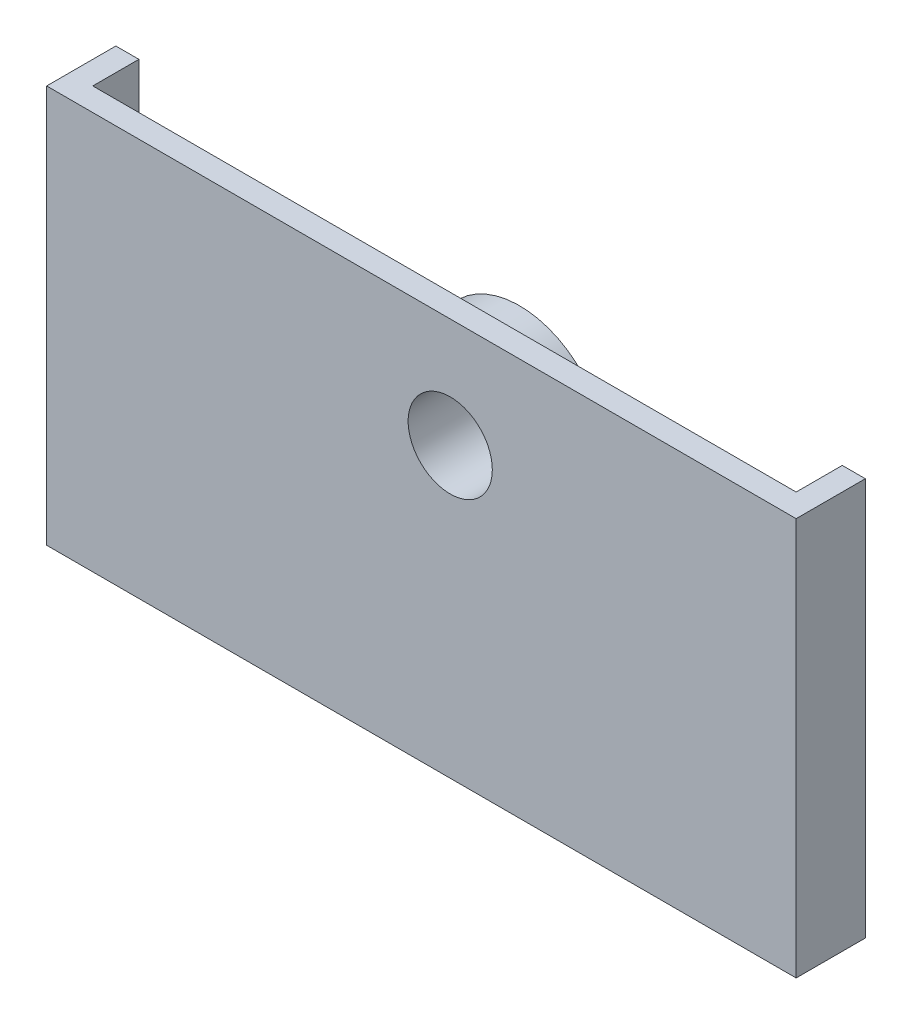
ISO-10303-21;
HEADER;
FILE_DESCRIPTION(('STEP AP214'),'2;1');
FILE_NAME('part.step','',(''),(''),'','','');
FILE_SCHEMA(('AUTOMOTIVE_DESIGN { 1 0 10303 214 1 1 1 1 }'));
ENDSEC;
DATA;
#1=APPLICATION_CONTEXT('core data for automotive mechanical design processes');
#2=APPLICATION_PROTOCOL_DEFINITION('international standard','automotive_design',2000,#1);
#3=PRODUCT_CONTEXT('',#1,'mechanical');
#4=PRODUCT('Part','Part','',(#3));
#5=PRODUCT_RELATED_PRODUCT_CATEGORY('part','',(#4));
#6=PRODUCT_DEFINITION_FORMATION('','',#4);
#7=PRODUCT_DEFINITION_CONTEXT('part definition',#1,'design');
#8=PRODUCT_DEFINITION('design','',#6,#7);
#9=PRODUCT_DEFINITION_SHAPE('','',#8);
#10=(LENGTH_UNIT() NAMED_UNIT(*) SI_UNIT(.MILLI.,.METRE.));
#11=(NAMED_UNIT(*) PLANE_ANGLE_UNIT() SI_UNIT($,.RADIAN.));
#12=(NAMED_UNIT(*) SI_UNIT($,.STERADIAN.) SOLID_ANGLE_UNIT());
#13=UNCERTAINTY_MEASURE_WITH_UNIT(LENGTH_MEASURE(1.E-05),#10,'distance_accuracy_value','');
#14=(GEOMETRIC_REPRESENTATION_CONTEXT(3) GLOBAL_UNCERTAINTY_ASSIGNED_CONTEXT((#13)) GLOBAL_UNIT_ASSIGNED_CONTEXT((#10,
#11,#12)) REPRESENTATION_CONTEXT('',''));
#15=CARTESIAN_POINT('',(0.,0.,0.));
#16=DIRECTION('',(0.,0.,1.));
#17=DIRECTION('',(1.,0.,0.));
#18=AXIS2_PLACEMENT_3D('',#15,#16,#17);
#19=CARTESIAN_POINT('',(-33.,-23.,-73.5883822352414));
#20=DIRECTION('',(-1.,0.,0.));
#21=DIRECTION('',(0.,0.,1.));
#22=AXIS2_PLACEMENT_3D('',#19,#20,#21);
#23=PLANE('',#22);
#24=DIRECTION('',(0.,-1.,0.));
#25=VECTOR('',#24,1.);
#26=CARTESIAN_POINT('',(-33.,-23.,4.));
#27=LINE('',#26,#25);
#28=CARTESIAN_POINT('',(-33.,9.5,4.));
#29=VERTEX_POINT('',#28);
#30=CARTESIAN_POINT('',(-33.,3.,4.));
#31=VERTEX_POINT('',#30);
#32=EDGE_CURVE('E270',#29,#31,#27,.T.);
#33=ORIENTED_EDGE('',*,*,#32,.T.);
#34=DIRECTION('',(0.,0.,-1.));
#35=VECTOR('',#34,1.);
#36=CARTESIAN_POINT('',(-33.,3.,5.));
#37=LINE('',#36,#35);
#38=CARTESIAN_POINT('',(-33.,3.,0.));
#39=VERTEX_POINT('',#38);
#40=EDGE_CURVE('E215',#31,#39,#37,.T.);
#41=ORIENTED_EDGE('',*,*,#40,.T.);
#42=DIRECTION('',(0.,1.,0.));
#43=VECTOR('',#42,1.);
#44=CARTESIAN_POINT('',(-33.,-23.,0.));
#45=LINE('',#44,#43);
#46=CARTESIAN_POINT('',(-33.,9.5,0.));
#47=VERTEX_POINT('',#46);
#48=EDGE_CURVE('E258',#39,#47,#45,.T.);
#49=ORIENTED_EDGE('',*,*,#48,.T.);
#50=DIRECTION('',(0.,0.,1.));
#51=VECTOR('',#50,1.);
#52=CARTESIAN_POINT('',(-33.,9.5,-73.5883822352414));
#53=LINE('',#52,#51);
#54=EDGE_CURVE('E286',#47,#29,#53,.T.);
#55=ORIENTED_EDGE('',*,*,#54,.T.);
#56=EDGE_LOOP('',(#33,#41,#49,#55));
#57=FACE_BOUND('',#56,.T.);
#58=ADVANCED_FACE('F41',(#57),#23,.F.);
#59=CARTESIAN_POINT('',(0.,0.,0.));
#60=DIRECTION('',(0.,0.,1.));
#61=DIRECTION('',(1.,0.,0.));
#62=AXIS2_PLACEMENT_3D('',#59,#60,#61);
#63=PLANE('',#62);
#64=ORIENTED_EDGE('',*,*,#48,.F.);
#65=DIRECTION('',(1.,0.,0.));
#66=VECTOR('',#65,1.);
#67=CARTESIAN_POINT('',(-33.,3.,0.));
#68=LINE('',#67,#66);
#69=CARTESIAN_POINT('',(-35.,3.,0.));
#70=VERTEX_POINT('',#69);
#71=EDGE_CURVE('E209',#70,#39,#68,.T.);
#72=ORIENTED_EDGE('',*,*,#71,.F.);
#73=DIRECTION('',(0.,-1.,0.));
#74=VECTOR('',#73,1.);
#75=CARTESIAN_POINT('',(-35.,-25.,0.));
#76=LINE('',#75,#74);
#77=CARTESIAN_POINT('',(-35.,9.5,0.));
#78=VERTEX_POINT('',#77);
#79=EDGE_CURVE('E266',#78,#70,#76,.T.);
#80=ORIENTED_EDGE('',*,*,#79,.F.);
#81=DIRECTION('',(-1.,0.,0.));
#82=VECTOR('',#81,1.);
#83=CARTESIAN_POINT('',(-35.,9.5,0.));
#84=LINE('',#83,#82);
#85=EDGE_CURVE('E262',#47,#78,#84,.T.);
#86=ORIENTED_EDGE('',*,*,#85,.F.);
#87=EDGE_LOOP('',(#64,#72,#80,#86));
#88=FACE_BOUND('',#87,.T.);
#89=ADVANCED_FACE('F411',(#88),#63,.F.);
#90=DIRECTION('',(1.,0.,0.));
#91=VECTOR('',#90,1.);
#92=CARTESIAN_POINT('',(30.,-25.,0.));
#93=LINE('',#92,#91);
#94=CARTESIAN_POINT('',(5.,-25.,0.));
#95=VERTEX_POINT('',#94);
#96=CARTESIAN_POINT('',(30.,-25.,0.));
#97=VERTEX_POINT('',#96);
#98=EDGE_CURVE('E288',#95,#97,#93,.T.);
#99=ORIENTED_EDGE('',*,*,#98,.F.);
#100=DIRECTION('',(0.,-1.,0.));
#101=VECTOR('',#100,1.);
#102=CARTESIAN_POINT('',(5.,-23.,0.));
#103=LINE('',#102,#101);
#104=CARTESIAN_POINT('',(5.,-23.,0.));
#105=VERTEX_POINT('',#104);
#106=EDGE_CURVE('E218',#105,#95,#103,.T.);
#107=ORIENTED_EDGE('',*,*,#106,.F.);
#108=DIRECTION('',(-1.,0.,0.));
#109=VECTOR('',#108,1.);
#110=CARTESIAN_POINT('',(28.,-23.,0.));
#111=LINE('',#110,#109);
#112=CARTESIAN_POINT('',(28.,-23.,0.));
#113=VERTEX_POINT('',#112);
#114=EDGE_CURVE('E255',#113,#105,#111,.T.);
#115=ORIENTED_EDGE('',*,*,#114,.F.);
#116=DIRECTION('',(0.,-1.,0.));
#117=VECTOR('',#116,1.);
#118=CARTESIAN_POINT('',(28.,7.49999999999999,0.));
#119=LINE('',#118,#117);
#120=CARTESIAN_POINT('',(28.,9.49999999999999,0.));
#121=VERTEX_POINT('',#120);
#122=EDGE_CURVE('E251',#121,#113,#119,.T.);
#123=ORIENTED_EDGE('',*,*,#122,.F.);
#124=DIRECTION('',(-1.,0.,0.));
#125=VECTOR('',#124,1.);
#126=CARTESIAN_POINT('',(28.,9.49999999999999,0.));
#127=LINE('',#126,#125);
#128=CARTESIAN_POINT('',(30.,9.5,0.));
#129=VERTEX_POINT('',#128);
#130=EDGE_CURVE('E247',#129,#121,#127,.T.);
#131=ORIENTED_EDGE('',*,*,#130,.F.);
#132=DIRECTION('',(0.,1.,0.));
#133=VECTOR('',#132,1.);
#134=CARTESIAN_POINT('',(30.,9.5,0.));
#135=LINE('',#134,#133);
#136=EDGE_CURVE('E244',#97,#129,#135,.T.);
#137=ORIENTED_EDGE('',*,*,#136,.F.);
#138=EDGE_LOOP('',(#99,#107,#115,#123,#131,#137));
#139=FACE_BOUND('',#138,.T.);
#140=ADVANCED_FACE('F376',(#139),#63,.F.);
#141=CARTESIAN_POINT('',(0.,0.,4.));
#142=DIRECTION('',(0.,0.,-1.));
#143=DIRECTION('',(-1.,0.,0.));
#144=AXIS2_PLACEMENT_3D('',#141,#142,#143);
#145=PLANE('',#144);
#146=DIRECTION('',(-1.,0.,0.));
#147=VECTOR('',#146,1.);
#148=CARTESIAN_POINT('',(-9.95012437887911,-7.,4.));
#149=LINE('',#148,#147);
#150=CARTESIAN_POINT('',(-27.5,-7.,4.));
#151=VERTEX_POINT('',#150);
#152=CARTESIAN_POINT('',(-33.,-7.,4.));
#153=VERTEX_POINT('',#152);
#154=EDGE_CURVE('E180',#151,#153,#149,.T.);
#155=ORIENTED_EDGE('',*,*,#154,.F.);
#156=DIRECTION('',(0.,-1.,0.));
#157=VECTOR('',#156,1.);
#158=CARTESIAN_POINT('',(-27.5,3.,4.));
#159=LINE('',#158,#157);
#160=CARTESIAN_POINT('',(-27.5,3.,4.));
#161=VERTEX_POINT('',#160);
#162=EDGE_CURVE('E189',#161,#151,#159,.T.);
#163=ORIENTED_EDGE('',*,*,#162,.F.);
#164=DIRECTION('',(-1.,0.,0.));
#165=VECTOR('',#164,1.);
#166=CARTESIAN_POINT('',(-9.95012437887911,3.,4.));
#167=LINE('',#166,#165);
#168=EDGE_CURVE('E204',#161,#31,#167,.T.);
#169=ORIENTED_EDGE('',*,*,#168,.T.);
#170=ORIENTED_EDGE('',*,*,#32,.F.);
#171=DIRECTION('',(-1.,0.,0.));
#172=VECTOR('',#171,1.);
#173=CARTESIAN_POINT('',(-35.,9.5,4.));
#174=LINE('',#173,#172);
#175=CARTESIAN_POINT('',(28.,9.49999999999999,4.));
#176=VERTEX_POINT('',#175);
#177=EDGE_CURVE('E293',#176,#29,#174,.T.);
#178=ORIENTED_EDGE('',*,*,#177,.F.);
#179=DIRECTION('',(0.,1.,0.));
#180=VECTOR('',#179,1.);
#181=CARTESIAN_POINT('',(28.,7.49999999999999,4.));
#182=LINE('',#181,#180);
#183=CARTESIAN_POINT('',(28.,-23.,4.));
#184=VERTEX_POINT('',#183);
#185=EDGE_CURVE('E276',#184,#176,#182,.T.);
#186=ORIENTED_EDGE('',*,*,#185,.F.);
#187=DIRECTION('',(1.,0.,0.));
#188=VECTOR('',#187,1.);
#189=CARTESIAN_POINT('',(28.,-23.,4.));
#190=LINE('',#189,#188);
#191=CARTESIAN_POINT('',(-33.,-23.,4.));
#192=VERTEX_POINT('',#191);
#193=EDGE_CURVE('E273',#192,#184,#190,.T.);
#194=ORIENTED_EDGE('',*,*,#193,.F.);
#195=EDGE_CURVE('E200',#153,#192,#27,.T.);
#196=ORIENTED_EDGE('',*,*,#195,.F.);
#197=EDGE_LOOP('',(#155,#163,#169,#170,#178,#186,#194,#196));
#198=FACE_BOUND('',#197,.T.);
#199=CARTESIAN_POINT('',(0.,0.,4.));
#200=DIRECTION('',(0.,0.,1.));
#201=DIRECTION('',(1.,0.,0.));
#202=AXIS2_PLACEMENT_3D('',#199,#200,#201);
#203=CIRCLE('',#202,7.5);
#204=CARTESIAN_POINT('',(7.5,0.,4.));
#205=VERTEX_POINT('',#204);
#206=EDGE_CURVE('E319',#205,#205,#203,.T.);
#207=ORIENTED_EDGE('',*,*,#206,.T.);
#208=EDGE_LOOP('',(#207));
#209=FACE_BOUND('',#208,.T.);
#210=ADVANCED_FACE('F197',(#198,#209),#145,.T.);
#211=CARTESIAN_POINT('',(0.,0.,0.));
#212=DIRECTION('',(0.,0.,1.));
#213=DIRECTION('',(1.,0.,0.));
#214=AXIS2_PLACEMENT_3D('',#211,#212,#213);
#215=PLANE('',#214);
#216=CARTESIAN_POINT('',(0.,0.,0.));
#217=DIRECTION('',(0.,0.,1.));
#218=DIRECTION('',(1.,0.,0.));
#219=AXIS2_PLACEMENT_3D('',#216,#217,#218);
#220=CIRCLE('',#219,7.5);
#221=CARTESIAN_POINT('',(7.5,0.,0.));
#222=VERTEX_POINT('',#221);
#223=EDGE_CURVE('E318',#222,#222,#220,.T.);
#224=ORIENTED_EDGE('',*,*,#223,.F.);
#225=EDGE_LOOP('',(#224));
#226=FACE_BOUND('',#225,.T.);
#227=CARTESIAN_POINT('',(0.,0.,0.));
#228=DIRECTION('',(0.,0.,1.));
#229=DIRECTION('',(1.,0.,0.));
#230=AXIS2_PLACEMENT_3D('',#227,#228,#229);
#231=CIRCLE('',#230,3.65);
#232=CARTESIAN_POINT('',(3.65,0.,0.));
#233=VERTEX_POINT('',#232);
#234=EDGE_CURVE('E315',#233,#233,#231,.T.);
#235=ORIENTED_EDGE('',*,*,#234,.T.);
#236=EDGE_LOOP('',(#235));
#237=FACE_BOUND('',#236,.T.);
#238=ADVANCED_FACE('F506',(#226,#237),#215,.F.);
#239=CARTESIAN_POINT('',(0.,0.,4.));
#240=DIRECTION('',(0.,0.,-1.));
#241=DIRECTION('',(-1.,0.,0.));
#242=AXIS2_PLACEMENT_3D('',#239,#240,#241);
#243=CYLINDRICAL_SURFACE('',#242,7.5);
#244=ORIENTED_EDGE('',*,*,#206,.F.);
#245=EDGE_LOOP('',(#244));
#246=FACE_BOUND('',#245,.T.);
#247=ORIENTED_EDGE('',*,*,#223,.T.);
#248=EDGE_LOOP('',(#247));
#249=FACE_BOUND('',#248,.T.);
#250=ADVANCED_FACE('F568',(#246,#249),#243,.T.);
#251=CARTESIAN_POINT('',(0.,0.,4.));
#252=DIRECTION('',(0.,0.,-1.));
#253=DIRECTION('',(-1.,0.,0.));
#254=AXIS2_PLACEMENT_3D('',#251,#252,#253);
#255=CYLINDRICAL_SURFACE('',#254,3.65);
#256=ORIENTED_EDGE('',*,*,#234,.F.);
#257=EDGE_LOOP('',(#256));
#258=FACE_BOUND('',#257,.T.);
#259=CARTESIAN_POINT('',(0.,0.,6.));
#260=DIRECTION('',(0.,0.,1.));
#261=DIRECTION('',(1.,0.,0.));
#262=AXIS2_PLACEMENT_3D('',#259,#260,#261);
#263=CIRCLE('',#262,3.65);
#264=CARTESIAN_POINT('',(3.65,0.,6.));
#265=VERTEX_POINT('',#264);
#266=EDGE_CURVE('E269',#265,#265,#263,.T.);
#267=ORIENTED_EDGE('',*,*,#266,.T.);
#268=EDGE_LOOP('',(#267));
#269=FACE_BOUND('',#268,.T.);
#270=ADVANCED_FACE('F565',(#258,#269),#255,.F.);
#271=CARTESIAN_POINT('',(0.,0.,6.));
#272=DIRECTION('',(0.,0.,-1.));
#273=DIRECTION('',(-1.,0.,0.));
#274=AXIS2_PLACEMENT_3D('',#271,#272,#273);
#275=PLANE('',#274);
#276=DIRECTION('',(-1.,0.,0.));
#277=VECTOR('',#276,1.);
#278=CARTESIAN_POINT('',(-35.,9.5,6.));
#279=LINE('',#278,#277);
#280=CARTESIAN_POINT('',(30.,9.5,6.));
#281=VERTEX_POINT('',#280);
#282=CARTESIAN_POINT('',(-35.,9.5,6.));
#283=VERTEX_POINT('',#282);
#284=EDGE_CURVE('E294',#281,#283,#279,.T.);
#285=ORIENTED_EDGE('',*,*,#284,.T.);
#286=DIRECTION('',(0.,-1.,0.));
#287=VECTOR('',#286,1.);
#288=CARTESIAN_POINT('',(-35.,-25.,6.));
#289=LINE('',#288,#287);
#290=CARTESIAN_POINT('',(-35.,-25.,6.));
#291=VERTEX_POINT('',#290);
#292=EDGE_CURVE('E297',#283,#291,#289,.T.);
#293=ORIENTED_EDGE('',*,*,#292,.T.);
#294=DIRECTION('',(1.,0.,0.));
#295=VECTOR('',#294,1.);
#296=CARTESIAN_POINT('',(30.,-25.,6.));
#297=LINE('',#296,#295);
#298=CARTESIAN_POINT('',(30.,-25.,6.));
#299=VERTEX_POINT('',#298);
#300=EDGE_CURVE('E299',#291,#299,#297,.T.);
#301=ORIENTED_EDGE('',*,*,#300,.T.);
#302=DIRECTION('',(0.,1.,0.));
#303=VECTOR('',#302,1.);
#304=CARTESIAN_POINT('',(30.,9.5,6.));
#305=LINE('',#304,#303);
#306=EDGE_CURVE('E301',#299,#281,#305,.T.);
#307=ORIENTED_EDGE('',*,*,#306,.T.);
#308=EDGE_LOOP('',(#285,#293,#301,#307));
#309=FACE_BOUND('',#308,.T.);
#310=ORIENTED_EDGE('',*,*,#266,.F.);
#311=EDGE_LOOP('',(#310));
#312=FACE_BOUND('',#311,.T.);
#313=ADVANCED_FACE('F387',(#309,#312),#275,.F.);
#314=CARTESIAN_POINT('',(-35.,9.5,6.));
#315=DIRECTION('',(0.,-1.,0.));
#316=DIRECTION('',(0.,0.,-1.));
#317=AXIS2_PLACEMENT_3D('',#314,#315,#316);
#318=PLANE('',#317);
#319=DIRECTION('',(0.,0.,-1.));
#320=VECTOR('',#319,1.);
#321=CARTESIAN_POINT('',(30.,9.5,6.));
#322=LINE('',#321,#320);
#323=EDGE_CURVE('E303',#281,#129,#322,.T.);
#324=ORIENTED_EDGE('',*,*,#323,.T.);
#325=ORIENTED_EDGE('',*,*,#130,.T.);
#326=DIRECTION('',(0.,0.,1.));
#327=VECTOR('',#326,1.);
#328=CARTESIAN_POINT('',(28.,9.49999999999999,-73.5883822352414));
#329=LINE('',#328,#327);
#330=EDGE_CURVE('E279',#121,#176,#329,.T.);
#331=ORIENTED_EDGE('',*,*,#330,.T.);
#332=ORIENTED_EDGE('',*,*,#177,.T.);
#333=ORIENTED_EDGE('',*,*,#54,.F.);
#334=ORIENTED_EDGE('',*,*,#85,.T.);
#335=DIRECTION('',(0.,0.,-1.));
#336=VECTOR('',#335,1.);
#337=CARTESIAN_POINT('',(-35.,9.5,6.));
#338=LINE('',#337,#336);
#339=EDGE_CURVE('E313',#283,#78,#338,.T.);
#340=ORIENTED_EDGE('',*,*,#339,.F.);
#341=ORIENTED_EDGE('',*,*,#284,.F.);
#342=EDGE_LOOP('',(#324,#325,#331,#332,#333,#334,#340,#341));
#343=FACE_BOUND('',#342,.T.);
#344=ADVANCED_FACE('F405',(#343),#318,.F.);
#345=CARTESIAN_POINT('',(-35.,-25.,6.));
#346=DIRECTION('',(1.,0.,0.));
#347=DIRECTION('',(0.,1.,0.));
#348=AXIS2_PLACEMENT_3D('',#345,#346,#347);
#349=PLANE('',#348);
#350=ORIENTED_EDGE('',*,*,#79,.T.);
#351=DIRECTION('',(0.,0.,-1.));
#352=VECTOR('',#351,1.);
#353=CARTESIAN_POINT('',(-35.,3.,5.));
#354=LINE('',#353,#352);
#355=CARTESIAN_POINT('',(-35.,3.,5.));
#356=VERTEX_POINT('',#355);
#357=EDGE_CURVE('E219',#356,#70,#354,.T.);
#358=ORIENTED_EDGE('',*,*,#357,.F.);
#359=DIRECTION('',(0.,1.,0.));
#360=VECTOR('',#359,1.);
#361=CARTESIAN_POINT('',(-35.,3.,5.));
#362=LINE('',#361,#360);
#363=CARTESIAN_POINT('',(-35.,-7.,5.));
#364=VERTEX_POINT('',#363);
#365=EDGE_CURVE('E208',#364,#356,#362,.T.);
#366=ORIENTED_EDGE('',*,*,#365,.F.);
#367=DIRECTION('',(0.,0.,-1.));
#368=VECTOR('',#367,1.);
#369=CARTESIAN_POINT('',(-35.,-7.,5.));
#370=LINE('',#369,#368);
#371=CARTESIAN_POINT('',(-35.,-7.,0.));
#372=VERTEX_POINT('',#371);
#373=EDGE_CURVE('E221',#364,#372,#370,.T.);
#374=ORIENTED_EDGE('',*,*,#373,.T.);
#375=CARTESIAN_POINT('',(-35.,-25.,0.));
#376=VERTEX_POINT('',#375);
#377=EDGE_CURVE('E265',#372,#376,#76,.T.);
#378=ORIENTED_EDGE('',*,*,#377,.T.);
#379=DIRECTION('',(0.,0.,-1.));
#380=VECTOR('',#379,1.);
#381=CARTESIAN_POINT('',(-35.,-25.,6.));
#382=LINE('',#381,#380);
#383=EDGE_CURVE('E310',#291,#376,#382,.T.);
#384=ORIENTED_EDGE('',*,*,#383,.F.);
#385=ORIENTED_EDGE('',*,*,#292,.F.);
#386=ORIENTED_EDGE('',*,*,#339,.T.);
#387=EDGE_LOOP('',(#350,#358,#366,#374,#378,#384,#385,#386));
#388=FACE_BOUND('',#387,.T.);
#389=ADVANCED_FACE('F392',(#388),#349,.F.);
#390=CARTESIAN_POINT('',(30.,-25.,6.));
#391=DIRECTION('',(0.,1.,0.));
#392=DIRECTION('',(-1.,0.,0.));
#393=AXIS2_PLACEMENT_3D('',#390,#391,#392);
#394=PLANE('',#393);
#395=DIRECTION('',(-1.,0.,0.));
#396=VECTOR('',#395,1.);
#397=CARTESIAN_POINT('',(5.,-25.,3.7));
#398=LINE('',#397,#396);
#399=CARTESIAN_POINT('',(3.5,-25.,3.7));
#400=VERTEX_POINT('',#399);
#401=CARTESIAN_POINT('',(-3.5,-25.,3.7));
#402=VERTEX_POINT('',#401);
#403=EDGE_CURVE('E225',#400,#402,#398,.T.);
#404=ORIENTED_EDGE('',*,*,#403,.F.);
#405=CARTESIAN_POINT('',(3.5,-25.,2.2));
#406=DIRECTION('',(0.,1.,0.));
#407=DIRECTION('',(-1.,0.,0.));
#408=AXIS2_PLACEMENT_3D('',#405,#406,#407);
#409=CIRCLE('',#408,1.5);
#410=CARTESIAN_POINT('',(5.,-25.,2.2));
#411=VERTEX_POINT('',#410);
#412=EDGE_CURVE('E49',#400,#411,#409,.T.);
#413=ORIENTED_EDGE('',*,*,#412,.T.);
#414=DIRECTION('',(0.,0.,-1.));
#415=VECTOR('',#414,1.);
#416=CARTESIAN_POINT('',(5.,-25.,3.7));
#417=LINE('',#416,#415);
#418=EDGE_CURVE('E232',#411,#95,#417,.T.);
#419=ORIENTED_EDGE('',*,*,#418,.T.);
#420=ORIENTED_EDGE('',*,*,#98,.T.);
#421=DIRECTION('',(0.,0.,-1.));
#422=VECTOR('',#421,1.);
#423=CARTESIAN_POINT('',(30.,-25.,6.));
#424=LINE('',#423,#422);
#425=EDGE_CURVE('E307',#299,#97,#424,.T.);
#426=ORIENTED_EDGE('',*,*,#425,.F.);
#427=ORIENTED_EDGE('',*,*,#300,.F.);
#428=ORIENTED_EDGE('',*,*,#383,.T.);
#429=CARTESIAN_POINT('',(-5.,-25.,0.));
#430=VERTEX_POINT('',#429);
#431=EDGE_CURVE('E248',#376,#430,#93,.T.);
#432=ORIENTED_EDGE('',*,*,#431,.T.);
#433=DIRECTION('',(0.,0.,-1.));
#434=VECTOR('',#433,1.);
#435=CARTESIAN_POINT('',(-5.,-25.,3.7));
#436=LINE('',#435,#434);
#437=CARTESIAN_POINT('',(-5.,-25.,2.2));
#438=VERTEX_POINT('',#437);
#439=EDGE_CURVE('E241',#438,#430,#436,.T.);
#440=ORIENTED_EDGE('',*,*,#439,.F.);
#441=CARTESIAN_POINT('',(-3.5,-25.,2.2));
#442=DIRECTION('',(0.,1.,0.));
#443=DIRECTION('',(-1.,0.,0.));
#444=AXIS2_PLACEMENT_3D('',#441,#442,#443);
#445=CIRCLE('',#444,1.5);
#446=EDGE_CURVE('E335',#438,#402,#445,.T.);
#447=ORIENTED_EDGE('',*,*,#446,.T.);
#448=EDGE_LOOP('',(#404,#413,#419,#420,#426,#427,#428,#432,#440,#447));
#449=FACE_BOUND('',#448,.T.);
#450=ADVANCED_FACE('F338',(#449),#394,.F.);
#451=CARTESIAN_POINT('',(30.,9.5,6.));
#452=DIRECTION('',(-1.,0.,0.));
#453=DIRECTION('',(0.,-1.,0.));
#454=AXIS2_PLACEMENT_3D('',#451,#452,#453);
#455=PLANE('',#454);
#456=ORIENTED_EDGE('',*,*,#425,.T.);
#457=ORIENTED_EDGE('',*,*,#136,.T.);
#458=ORIENTED_EDGE('',*,*,#323,.F.);
#459=ORIENTED_EDGE('',*,*,#306,.F.);
#460=EDGE_LOOP('',(#456,#457,#458,#459));
#461=FACE_BOUND('',#460,.T.);
#462=ADVANCED_FACE('F383',(#461),#455,.F.);
#463=CARTESIAN_POINT('',(28.,7.49999999999999,-73.5883822352414));
#464=DIRECTION('',(1.,0.,0.));
#465=DIRECTION('',(0.,0.,-1.));
#466=AXIS2_PLACEMENT_3D('',#463,#464,#465);
#467=PLANE('',#466);
#468=ORIENTED_EDGE('',*,*,#330,.F.);
#469=ORIENTED_EDGE('',*,*,#122,.T.);
#470=DIRECTION('',(0.,0.,1.));
#471=VECTOR('',#470,1.);
#472=CARTESIAN_POINT('',(28.,-23.,-73.5883822352414));
#473=LINE('',#472,#471);
#474=EDGE_CURVE('E281',#113,#184,#473,.T.);
#475=ORIENTED_EDGE('',*,*,#474,.T.);
#476=ORIENTED_EDGE('',*,*,#185,.T.);
#477=EDGE_LOOP('',(#468,#469,#475,#476));
#478=FACE_BOUND('',#477,.T.);
#479=ADVANCED_FACE('F374',(#478),#467,.F.);
#480=CARTESIAN_POINT('',(28.,-23.,-73.5883822352414));
#481=DIRECTION('',(0.,-1.,0.));
#482=DIRECTION('',(1.,0.,0.));
#483=AXIS2_PLACEMENT_3D('',#480,#481,#482);
#484=PLANE('',#483);
#485=ORIENTED_EDGE('',*,*,#114,.T.);
#486=DIRECTION('',(0.,0.,-1.));
#487=VECTOR('',#486,1.);
#488=CARTESIAN_POINT('',(5.,-23.,3.7));
#489=LINE('',#488,#487);
#490=CARTESIAN_POINT('',(5.,-23.,2.2));
#491=VERTEX_POINT('',#490);
#492=EDGE_CURVE('E237',#491,#105,#489,.T.);
#493=ORIENTED_EDGE('',*,*,#492,.F.);
#494=CARTESIAN_POINT('',(3.5,-23.,2.2));
#495=DIRECTION('',(0.,-1.,0.));
#496=DIRECTION('',(1.,0.,0.));
#497=AXIS2_PLACEMENT_3D('',#494,#495,#496);
#498=CIRCLE('',#497,1.5);
#499=CARTESIAN_POINT('',(3.5,-23.,3.7));
#500=VERTEX_POINT('',#499);
#501=EDGE_CURVE('E12',#491,#500,#498,.T.);
#502=ORIENTED_EDGE('',*,*,#501,.T.);
#503=DIRECTION('',(1.,0.,0.));
#504=VECTOR('',#503,1.);
#505=CARTESIAN_POINT('',(5.,-23.,3.7));
#506=LINE('',#505,#504);
#507=CARTESIAN_POINT('',(-3.5,-23.,3.7));
#508=VERTEX_POINT('',#507);
#509=EDGE_CURVE('E228',#508,#500,#506,.T.);
#510=ORIENTED_EDGE('',*,*,#509,.F.);
#511=CARTESIAN_POINT('',(-3.5,-23.,2.2));
#512=DIRECTION('',(0.,-1.,0.));
#513=DIRECTION('',(1.,0.,0.));
#514=AXIS2_PLACEMENT_3D('',#511,#512,#513);
#515=CIRCLE('',#514,1.5);
#516=CARTESIAN_POINT('',(-5.,-23.,2.2));
#517=VERTEX_POINT('',#516);
#518=EDGE_CURVE('E333',#508,#517,#515,.T.);
#519=ORIENTED_EDGE('',*,*,#518,.T.);
#520=DIRECTION('',(0.,0.,-1.));
#521=VECTOR('',#520,1.);
#522=CARTESIAN_POINT('',(-5.,-23.,3.7));
#523=LINE('',#522,#521);
#524=CARTESIAN_POINT('',(-5.,-23.,0.));
#525=VERTEX_POINT('',#524);
#526=EDGE_CURVE('E239',#517,#525,#523,.T.);
#527=ORIENTED_EDGE('',*,*,#526,.T.);
#528=CARTESIAN_POINT('',(-33.,-23.,0.));
#529=VERTEX_POINT('',#528);
#530=EDGE_CURVE('E254',#525,#529,#111,.T.);
#531=ORIENTED_EDGE('',*,*,#530,.T.);
#532=DIRECTION('',(0.,0.,1.));
#533=VECTOR('',#532,1.);
#534=CARTESIAN_POINT('',(-33.,-23.,-73.5883822352414));
#535=LINE('',#534,#533);
#536=EDGE_CURVE('E283',#529,#192,#535,.T.);
#537=ORIENTED_EDGE('',*,*,#536,.T.);
#538=ORIENTED_EDGE('',*,*,#193,.T.);
#539=ORIENTED_EDGE('',*,*,#474,.F.);
#540=EDGE_LOOP('',(#485,#493,#502,#510,#519,#527,#531,#537,#538,#539));
#541=FACE_BOUND('',#540,.T.);
#542=ADVANCED_FACE('F347',(#541),#484,.F.);
#543=CARTESIAN_POINT('',(-33.,-7.,0.));
#544=VERTEX_POINT('',#543);
#545=EDGE_CURVE('E259',#529,#544,#45,.T.);
#546=ORIENTED_EDGE('',*,*,#545,.T.);
#547=DIRECTION('',(0.,0.,-1.));
#548=VECTOR('',#547,1.);
#549=CARTESIAN_POINT('',(-33.,-7.,5.));
#550=LINE('',#549,#548);
#551=EDGE_CURVE('E56',#153,#544,#550,.T.);
#552=ORIENTED_EDGE('',*,*,#551,.F.);
#553=ORIENTED_EDGE('',*,*,#195,.T.);
#554=ORIENTED_EDGE('',*,*,#536,.F.);
#555=EDGE_LOOP('',(#546,#552,#553,#554));
#556=FACE_BOUND('',#555,.T.);
#557=ADVANCED_FACE('F414',(#556),#23,.F.);
#558=ORIENTED_EDGE('',*,*,#377,.F.);
#559=DIRECTION('',(-1.,0.,0.));
#560=VECTOR('',#559,1.);
#561=CARTESIAN_POINT('',(-33.,-7.,0.));
#562=LINE('',#561,#560);
#563=EDGE_CURVE('E206',#544,#372,#562,.T.);
#564=ORIENTED_EDGE('',*,*,#563,.F.);
#565=ORIENTED_EDGE('',*,*,#545,.F.);
#566=ORIENTED_EDGE('',*,*,#530,.F.);
#567=DIRECTION('',(0.,1.,0.));
#568=VECTOR('',#567,1.);
#569=CARTESIAN_POINT('',(-5.,-23.,0.));
#570=LINE('',#569,#568);
#571=EDGE_CURVE('E229',#430,#525,#570,.T.);
#572=ORIENTED_EDGE('',*,*,#571,.F.);
#573=ORIENTED_EDGE('',*,*,#431,.F.);
#574=EDGE_LOOP('',(#558,#564,#565,#566,#572,#573));
#575=FACE_BOUND('',#574,.T.);
#576=ADVANCED_FACE('F365',(#575),#63,.F.);
#577=CARTESIAN_POINT('',(5.,-23.,3.7));
#578=DIRECTION('',(1.,0.,0.));
#579=DIRECTION('',(0.,1.,0.));
#580=AXIS2_PLACEMENT_3D('',#577,#578,#579);
#581=PLANE('',#580);
#582=ORIENTED_EDGE('',*,*,#418,.F.);
#583=DIRECTION('',(0.,-1.,0.));
#584=VECTOR('',#583,1.);
#585=CARTESIAN_POINT('',(5.,-23.,2.2));
#586=LINE('',#585,#584);
#587=EDGE_CURVE('E64',#411,#491,#586,.F.);
#588=ORIENTED_EDGE('',*,*,#587,.T.);
#589=ORIENTED_EDGE('',*,*,#492,.T.);
#590=ORIENTED_EDGE('',*,*,#106,.T.);
#591=EDGE_LOOP('',(#582,#588,#589,#590));
#592=FACE_BOUND('',#591,.T.);
#593=ADVANCED_FACE('F341',(#592),#581,.F.);
#594=CARTESIAN_POINT('',(-5.,-23.,3.7));
#595=DIRECTION('',(-1.,0.,0.));
#596=DIRECTION('',(0.,-1.,0.));
#597=AXIS2_PLACEMENT_3D('',#594,#595,#596);
#598=PLANE('',#597);
#599=ORIENTED_EDGE('',*,*,#526,.F.);
#600=DIRECTION('',(0.,1.,0.));
#601=VECTOR('',#600,1.);
#602=CARTESIAN_POINT('',(-5.,-23.,2.2));
#603=LINE('',#602,#601);
#604=EDGE_CURVE('E330',#517,#438,#603,.F.);
#605=ORIENTED_EDGE('',*,*,#604,.T.);
#606=ORIENTED_EDGE('',*,*,#439,.T.);
#607=ORIENTED_EDGE('',*,*,#571,.T.);
#608=EDGE_LOOP('',(#599,#605,#606,#607));
#609=FACE_BOUND('',#608,.T.);
#610=ADVANCED_FACE('F357',(#609),#598,.F.);
#611=CARTESIAN_POINT('',(0.,0.,3.7));
#612=DIRECTION('',(0.,0.,-1.));
#613=DIRECTION('',(-1.,0.,0.));
#614=AXIS2_PLACEMENT_3D('',#611,#612,#613);
#615=PLANE('',#614);
#616=ORIENTED_EDGE('',*,*,#403,.T.);
#617=DIRECTION('',(0.,1.,0.));
#618=VECTOR('',#617,1.);
#619=CARTESIAN_POINT('',(-3.50000000000001,0.,3.7));
#620=LINE('',#619,#618);
#621=EDGE_CURVE('E327',#402,#508,#620,.T.);
#622=ORIENTED_EDGE('',*,*,#621,.T.);
#623=ORIENTED_EDGE('',*,*,#509,.T.);
#624=DIRECTION('',(0.,-1.,0.));
#625=VECTOR('',#624,1.);
#626=CARTESIAN_POINT('',(3.50000000000001,0.,3.7));
#627=LINE('',#626,#625);
#628=EDGE_CURVE('E322',#500,#400,#627,.T.);
#629=ORIENTED_EDGE('',*,*,#628,.T.);
#630=EDGE_LOOP('',(#616,#622,#623,#629));
#631=FACE_BOUND('',#630,.T.);
#632=ADVANCED_FACE('F349',(#631),#615,.T.);
#633=CARTESIAN_POINT('',(-3.50000000000001,0.,2.2));
#634=DIRECTION('',(0.,1.,0.));
#635=DIRECTION('',(-1.,0.,0.));
#636=AXIS2_PLACEMENT_3D('',#633,#634,#635);
#637=CYLINDRICAL_SURFACE('',#636,1.5);
#638=ORIENTED_EDGE('',*,*,#446,.F.);
#639=ORIENTED_EDGE('',*,*,#604,.F.);
#640=ORIENTED_EDGE('',*,*,#518,.F.);
#641=ORIENTED_EDGE('',*,*,#621,.F.);
#642=EDGE_LOOP('',(#638,#639,#640,#641));
#643=FACE_BOUND('',#642,.T.);
#644=ADVANCED_FACE('F353',(#643),#637,.F.);
#645=CARTESIAN_POINT('',(3.50000000000001,0.,2.2));
#646=DIRECTION('',(0.,-1.,0.));
#647=DIRECTION('',(1.,0.,0.));
#648=AXIS2_PLACEMENT_3D('',#645,#646,#647);
#649=CYLINDRICAL_SURFACE('',#648,1.5);
#650=ORIENTED_EDGE('',*,*,#501,.F.);
#651=ORIENTED_EDGE('',*,*,#587,.F.);
#652=ORIENTED_EDGE('',*,*,#412,.F.);
#653=ORIENTED_EDGE('',*,*,#628,.F.);
#654=EDGE_LOOP('',(#650,#651,#652,#653));
#655=FACE_BOUND('',#654,.T.);
#656=ADVANCED_FACE('F43',(#655),#649,.F.);
#657=CARTESIAN_POINT('',(-33.,3.,5.));
#658=DIRECTION('',(0.,1.,0.));
#659=DIRECTION('',(-1.,0.,0.));
#660=AXIS2_PLACEMENT_3D('',#657,#658,#659);
#661=PLANE('',#660);
#662=ORIENTED_EDGE('',*,*,#71,.T.);
#663=ORIENTED_EDGE('',*,*,#40,.F.);
#664=ORIENTED_EDGE('',*,*,#168,.F.);
#665=DIRECTION('',(0.,0.,-1.));
#666=VECTOR('',#665,1.);
#667=CARTESIAN_POINT('',(-27.5,3.,5.));
#668=LINE('',#667,#666);
#669=CARTESIAN_POINT('',(-27.5,3.,5.));
#670=VERTEX_POINT('',#669);
#671=EDGE_CURVE('E192',#670,#161,#668,.T.);
#672=ORIENTED_EDGE('',*,*,#671,.F.);
#673=DIRECTION('',(1.,0.,0.));
#674=VECTOR('',#673,1.);
#675=CARTESIAN_POINT('',(-33.,3.,5.));
#676=LINE('',#675,#674);
#677=EDGE_CURVE('E211',#356,#670,#676,.T.);
#678=ORIENTED_EDGE('',*,*,#677,.F.);
#679=ORIENTED_EDGE('',*,*,#357,.T.);
#680=EDGE_LOOP('',(#662,#663,#664,#672,#678,#679));
#681=FACE_BOUND('',#680,.T.);
#682=ADVANCED_FACE('F400',(#681),#661,.F.);
#683=CARTESIAN_POINT('',(-33.,-7.,5.));
#684=DIRECTION('',(0.,-1.,0.));
#685=DIRECTION('',(1.,0.,0.));
#686=AXIS2_PLACEMENT_3D('',#683,#684,#685);
#687=PLANE('',#686);
#688=ORIENTED_EDGE('',*,*,#563,.T.);
#689=ORIENTED_EDGE('',*,*,#373,.F.);
#690=DIRECTION('',(-1.,0.,0.));
#691=VECTOR('',#690,1.);
#692=CARTESIAN_POINT('',(-33.,-7.,5.));
#693=LINE('',#692,#691);
#694=CARTESIAN_POINT('',(-27.5,-7.,5.));
#695=VERTEX_POINT('',#694);
#696=EDGE_CURVE('E182',#695,#364,#693,.T.);
#697=ORIENTED_EDGE('',*,*,#696,.F.);
#698=DIRECTION('',(0.,0.,1.));
#699=VECTOR('',#698,1.);
#700=CARTESIAN_POINT('',(-27.5,-7.,4.));
#701=LINE('',#700,#699);
#702=EDGE_CURVE('E176',#151,#695,#701,.T.);
#703=ORIENTED_EDGE('',*,*,#702,.F.);
#704=ORIENTED_EDGE('',*,*,#154,.T.);
#705=ORIENTED_EDGE('',*,*,#551,.T.);
#706=EDGE_LOOP('',(#688,#689,#697,#703,#704,#705));
#707=FACE_BOUND('',#706,.T.);
#708=ADVANCED_FACE('F178',(#707),#687,.F.);
#709=CARTESIAN_POINT('',(0.,0.,5.));
#710=DIRECTION('',(0.,0.,-1.));
#711=DIRECTION('',(-1.,0.,0.));
#712=AXIS2_PLACEMENT_3D('',#709,#710,#711);
#713=PLANE('',#712);
#714=ORIENTED_EDGE('',*,*,#677,.T.);
#715=DIRECTION('',(0.,1.,0.));
#716=VECTOR('',#715,1.);
#717=CARTESIAN_POINT('',(-27.5,-7.,5.));
#718=LINE('',#717,#716);
#719=EDGE_CURVE('E186',#695,#670,#718,.T.);
#720=ORIENTED_EDGE('',*,*,#719,.F.);
#721=ORIENTED_EDGE('',*,*,#696,.T.);
#722=ORIENTED_EDGE('',*,*,#365,.T.);
#723=EDGE_LOOP('',(#714,#720,#721,#722));
#724=FACE_BOUND('',#723,.T.);
#725=ADVANCED_FACE('F396',(#724),#713,.T.);
#726=CARTESIAN_POINT('',(-27.5,-25.,6.));
#727=DIRECTION('',(1.,0.,0.));
#728=DIRECTION('',(0.,1.,0.));
#729=AXIS2_PLACEMENT_3D('',#726,#727,#728);
#730=PLANE('',#729);
#731=ORIENTED_EDGE('',*,*,#671,.T.);
#732=ORIENTED_EDGE('',*,*,#162,.T.);
#733=ORIENTED_EDGE('',*,*,#702,.T.);
#734=ORIENTED_EDGE('',*,*,#719,.T.);
#735=EDGE_LOOP('',(#731,#732,#733,#734));
#736=FACE_BOUND('',#735,.T.);
#737=ADVANCED_FACE('F190',(#736),#730,.F.);
#738=CLOSED_SHELL('',(#58,#89,#140,#210,#238,#250,#270,#313,#344,#389,#450,#462,#479,#542,#557,
#576,#593,#610,#632,#644,#656,#682,#708,#725,#737));
#739=MANIFOLD_SOLID_BREP('B2',#738);
#740=ADVANCED_BREP_SHAPE_REPRESENTATION('',(#18,#739),#14);
#741=SHAPE_DEFINITION_REPRESENTATION(#9,#740);
ENDSEC;
END-ISO-10303-21;
